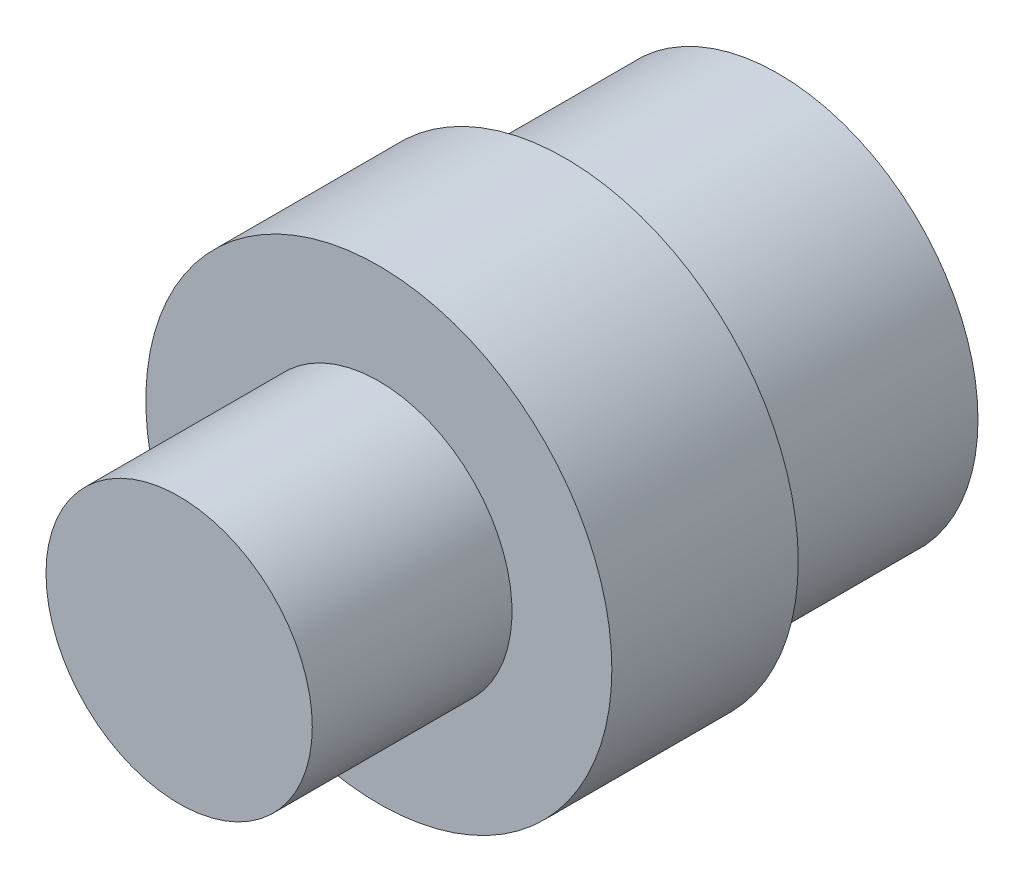
ISO-10303-21;
HEADER;
FILE_DESCRIPTION(('STEP AP214'),'2;1');
FILE_NAME('part.step','',(''),(''),'','','');
FILE_SCHEMA(('AUTOMOTIVE_DESIGN { 1 0 10303 214 1 1 1 1 }'));
ENDSEC;
DATA;
#1=APPLICATION_CONTEXT('core data for automotive mechanical design processes');
#2=APPLICATION_PROTOCOL_DEFINITION('international standard','automotive_design',2000,#1);
#3=PRODUCT_CONTEXT('',#1,'mechanical');
#4=PRODUCT('Part','Part','',(#3));
#5=PRODUCT_RELATED_PRODUCT_CATEGORY('part','',(#4));
#6=PRODUCT_DEFINITION_FORMATION('','',#4);
#7=PRODUCT_DEFINITION_CONTEXT('part definition',#1,'design');
#8=PRODUCT_DEFINITION('design','',#6,#7);
#9=PRODUCT_DEFINITION_SHAPE('','',#8);
#10=(LENGTH_UNIT() NAMED_UNIT(*) SI_UNIT(.MILLI.,.METRE.));
#11=(NAMED_UNIT(*) PLANE_ANGLE_UNIT() SI_UNIT($,.RADIAN.));
#12=(NAMED_UNIT(*) SI_UNIT($,.STERADIAN.) SOLID_ANGLE_UNIT());
#13=UNCERTAINTY_MEASURE_WITH_UNIT(LENGTH_MEASURE(1.E-05),#10,'distance_accuracy_value','');
#14=(GEOMETRIC_REPRESENTATION_CONTEXT(3) GLOBAL_UNCERTAINTY_ASSIGNED_CONTEXT((#13)) GLOBAL_UNIT_ASSIGNED_CONTEXT((#10,
#11,#12)) REPRESENTATION_CONTEXT('',''));
#15=CARTESIAN_POINT('',(0.,0.,0.));
#16=DIRECTION('',(0.,0.,1.));
#17=DIRECTION('',(1.,0.,0.));
#18=AXIS2_PLACEMENT_3D('',#15,#16,#17);
#19=CARTESIAN_POINT('',(0.,0.,9.525));
#20=DIRECTION('',(0.,0.,-1.));
#21=DIRECTION('',(-1.,0.,0.));
#22=AXIS2_PLACEMENT_3D('',#19,#20,#21);
#23=CYLINDRICAL_SURFACE('',#22,6.35);
#24=CARTESIAN_POINT('',(0.,0.,9.525));
#25=DIRECTION('',(0.,0.,1.));
#26=DIRECTION('',(1.,0.,0.));
#27=AXIS2_PLACEMENT_3D('',#24,#25,#26);
#28=CIRCLE('',#27,6.35);
#29=CARTESIAN_POINT('',(6.35,0.,9.525));
#30=VERTEX_POINT('',#29);
#31=EDGE_CURVE('E38',#30,#30,#28,.T.);
#32=ORIENTED_EDGE('',*,*,#31,.F.);
#33=EDGE_LOOP('',(#32));
#34=FACE_BOUND('',#33,.T.);
#35=CARTESIAN_POINT('',(0.,0.,0.));
#36=DIRECTION('',(0.,0.,-1.));
#37=DIRECTION('',(-1.,0.,0.));
#38=AXIS2_PLACEMENT_3D('',#35,#36,#37);
#39=CIRCLE('',#38,6.35);
#40=CARTESIAN_POINT('',(-6.35,0.,0.));
#41=VERTEX_POINT('',#40);
#42=EDGE_CURVE('E42',#41,#41,#39,.T.);
#43=ORIENTED_EDGE('',*,*,#42,.F.);
#44=EDGE_LOOP('',(#43));
#45=FACE_BOUND('',#44,.T.);
#46=ADVANCED_FACE('F32',(#34,#45),#23,.T.);
#47=CARTESIAN_POINT('',(0.,0.,9.525));
#48=DIRECTION('',(0.,0.,1.));
#49=DIRECTION('',(1.,0.,0.));
#50=AXIS2_PLACEMENT_3D('',#47,#48,#49);
#51=PLANE('',#50);
#52=ORIENTED_EDGE('',*,*,#31,.T.);
#53=EDGE_LOOP('',(#52));
#54=FACE_BOUND('',#53,.T.);
#55=ADVANCED_FACE('F71',(#54),#51,.T.);
#56=CARTESIAN_POINT('',(0.,0.,0.));
#57=DIRECTION('',(0.,0.,-1.));
#58=DIRECTION('',(-1.,0.,0.));
#59=AXIS2_PLACEMENT_3D('',#56,#57,#58);
#60=PLANE('',#59);
#61=ORIENTED_EDGE('',*,*,#42,.T.);
#62=EDGE_LOOP('',(#61));
#63=FACE_BOUND('',#62,.T.);
#64=CARTESIAN_POINT('',(0.,0.,0.));
#65=DIRECTION('',(0.,0.,1.));
#66=DIRECTION('',(1.,0.,0.));
#67=AXIS2_PLACEMENT_3D('',#64,#65,#66);
#68=CIRCLE('',#67,11.1125);
#69=CARTESIAN_POINT('',(11.1125,0.,0.));
#70=VERTEX_POINT('',#69);
#71=EDGE_CURVE('E52',#70,#70,#68,.T.);
#72=ORIENTED_EDGE('',*,*,#71,.T.);
#73=EDGE_LOOP('',(#72));
#74=FACE_BOUND('',#73,.T.);
#75=ADVANCED_FACE('F63',(#63,#74),#60,.F.);
#76=CARTESIAN_POINT('',(0.,0.,-8.89));
#77=DIRECTION('',(0.,0.,1.));
#78=DIRECTION('',(1.,0.,0.));
#79=AXIS2_PLACEMENT_3D('',#76,#77,#78);
#80=PLANE('',#79);
#81=CARTESIAN_POINT('',(0.,0.,-8.89));
#82=DIRECTION('',(0.,0.,1.));
#83=DIRECTION('',(1.,0.,0.));
#84=AXIS2_PLACEMENT_3D('',#81,#82,#83);
#85=CIRCLE('',#84,11.1125);
#86=CARTESIAN_POINT('',(11.1125,0.,-8.89));
#87=VERTEX_POINT('',#86);
#88=EDGE_CURVE('E51',#87,#87,#85,.T.);
#89=ORIENTED_EDGE('',*,*,#88,.F.);
#90=EDGE_LOOP('',(#89));
#91=FACE_BOUND('',#90,.T.);
#92=CARTESIAN_POINT('',(0.,0.,-8.89));
#93=DIRECTION('',(0.,0.,1.));
#94=DIRECTION('',(1.,0.,0.));
#95=AXIS2_PLACEMENT_3D('',#92,#93,#94);
#96=CIRCLE('',#95,9.525);
#97=CARTESIAN_POINT('',(9.525,0.,-8.89));
#98=VERTEX_POINT('',#97);
#99=EDGE_CURVE('E10',#98,#98,#96,.T.);
#100=ORIENTED_EDGE('',*,*,#99,.T.);
#101=EDGE_LOOP('',(#100));
#102=FACE_BOUND('',#101,.T.);
#103=ADVANCED_FACE('F61',(#91,#102),#80,.F.);
#104=CARTESIAN_POINT('',(0.,0.,-8.89));
#105=DIRECTION('',(0.,0.,1.));
#106=DIRECTION('',(1.,0.,0.));
#107=AXIS2_PLACEMENT_3D('',#104,#105,#106);
#108=CYLINDRICAL_SURFACE('',#107,11.1125);
#109=ORIENTED_EDGE('',*,*,#88,.T.);
#110=EDGE_LOOP('',(#109));
#111=FACE_BOUND('',#110,.T.);
#112=ORIENTED_EDGE('',*,*,#71,.F.);
#113=EDGE_LOOP('',(#112));
#114=FACE_BOUND('',#113,.T.);
#115=ADVANCED_FACE('F58',(#111,#114),#108,.T.);
#116=CARTESIAN_POINT('',(0.,0.,-19.05));
#117=DIRECTION('',(0.,0.,-1.));
#118=DIRECTION('',(-1.,0.,0.));
#119=AXIS2_PLACEMENT_3D('',#116,#117,#118);
#120=PLANE('',#119);
#121=CARTESIAN_POINT('',(0.,0.,-19.05));
#122=DIRECTION('',(0.,0.,-1.));
#123=DIRECTION('',(-1.,0.,0.));
#124=AXIS2_PLACEMENT_3D('',#121,#122,#123);
#125=CIRCLE('',#124,9.525);
#126=CARTESIAN_POINT('',(-9.525,0.,-19.05));
#127=VERTEX_POINT('',#126);
#128=EDGE_CURVE('E46',#127,#127,#125,.T.);
#129=ORIENTED_EDGE('',*,*,#128,.T.);
#130=EDGE_LOOP('',(#129));
#131=FACE_BOUND('',#130,.T.);
#132=ADVANCED_FACE('F69',(#131),#120,.T.);
#133=CARTESIAN_POINT('',(0.,0.,-19.05));
#134=DIRECTION('',(0.,0.,1.));
#135=DIRECTION('',(1.,0.,0.));
#136=AXIS2_PLACEMENT_3D('',#133,#134,#135);
#137=CYLINDRICAL_SURFACE('',#136,9.525);
#138=ORIENTED_EDGE('',*,*,#128,.F.);
#139=EDGE_LOOP('',(#138));
#140=FACE_BOUND('',#139,.T.);
#141=ORIENTED_EDGE('',*,*,#99,.F.);
#142=EDGE_LOOP('',(#141));
#143=FACE_BOUND('',#142,.T.);
#144=ADVANCED_FACE('F86',(#140,#143),#137,.T.);
#145=CLOSED_SHELL('',(#46,#55,#75,#103,#115,#132,#144));
#146=MANIFOLD_SOLID_BREP('B2',#145);
#147=ADVANCED_BREP_SHAPE_REPRESENTATION('',(#18,#146),#14);
#148=SHAPE_DEFINITION_REPRESENTATION(#9,#147);
ENDSEC;
END-ISO-10303-21;
